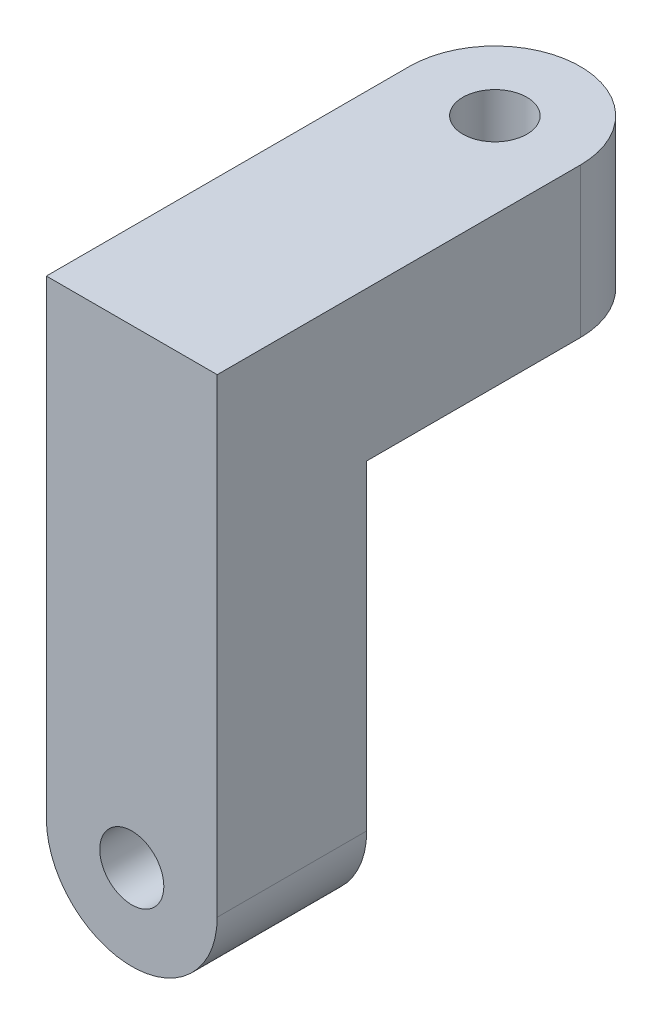
ISO-10303-21;
HEADER;
FILE_DESCRIPTION(('STEP AP214'),'2;1');
FILE_NAME('part.step','',(''),(''),'','','');
FILE_SCHEMA(('AUTOMOTIVE_DESIGN { 1 0 10303 214 1 1 1 1 }'));
ENDSEC;
DATA;
#1=APPLICATION_CONTEXT('core data for automotive mechanical design processes');
#2=APPLICATION_PROTOCOL_DEFINITION('international standard','automotive_design',2000,#1);
#3=PRODUCT_CONTEXT('',#1,'mechanical');
#4=PRODUCT('Part','Part','',(#3));
#5=PRODUCT_RELATED_PRODUCT_CATEGORY('part','',(#4));
#6=PRODUCT_DEFINITION_FORMATION('','',#4);
#7=PRODUCT_DEFINITION_CONTEXT('part definition',#1,'design');
#8=PRODUCT_DEFINITION('design','',#6,#7);
#9=PRODUCT_DEFINITION_SHAPE('','',#8);
#10=(LENGTH_UNIT() NAMED_UNIT(*) SI_UNIT(.MILLI.,.METRE.));
#11=(NAMED_UNIT(*) PLANE_ANGLE_UNIT() SI_UNIT($,.RADIAN.));
#12=(NAMED_UNIT(*) SI_UNIT($,.STERADIAN.) SOLID_ANGLE_UNIT());
#13=UNCERTAINTY_MEASURE_WITH_UNIT(LENGTH_MEASURE(1.E-05),#10,'distance_accuracy_value','');
#14=(GEOMETRIC_REPRESENTATION_CONTEXT(3) GLOBAL_UNCERTAINTY_ASSIGNED_CONTEXT((#13)) GLOBAL_UNIT_ASSIGNED_CONTEXT((#10,
#11,#12)) REPRESENTATION_CONTEXT('',''));
#15=CARTESIAN_POINT('',(0.,0.,0.));
#16=DIRECTION('',(0.,0.,1.));
#17=DIRECTION('',(1.,0.,0.));
#18=AXIS2_PLACEMENT_3D('',#15,#16,#17);
#19=CARTESIAN_POINT('',(0.,-15.,7.));
#20=DIRECTION('',(0.,0.,1.));
#21=DIRECTION('',(1.,0.,0.));
#22=AXIS2_PLACEMENT_3D('',#19,#20,#21);
#23=PLANE('',#22);
#24=CARTESIAN_POINT('',(0.,-15.,7.));
#25=DIRECTION('',(0.,0.,1.));
#26=DIRECTION('',(1.,0.,0.));
#27=AXIS2_PLACEMENT_3D('',#24,#25,#26);
#28=CIRCLE('',#27,4.);
#29=CARTESIAN_POINT('',(-4.,-15.,7.));
#30=VERTEX_POINT('',#29);
#31=CARTESIAN_POINT('',(4.,-15.,7.));
#32=VERTEX_POINT('',#31);
#33=EDGE_CURVE('E78',#30,#32,#28,.T.);
#34=ORIENTED_EDGE('',*,*,#33,.T.);
#35=DIRECTION('',(0.,1.,0.));
#36=VECTOR('',#35,1.);
#37=CARTESIAN_POINT('',(4.,0.,7.));
#38=LINE('',#37,#36);
#39=CARTESIAN_POINT('',(4.,7.,7.));
#40=VERTEX_POINT('',#39);
#41=EDGE_CURVE('E147',#32,#40,#38,.T.);
#42=ORIENTED_EDGE('',*,*,#41,.T.);
#43=DIRECTION('',(1.,0.,0.));
#44=VECTOR('',#43,1.);
#45=CARTESIAN_POINT('',(0.,7.,7.));
#46=LINE('',#45,#44);
#47=CARTESIAN_POINT('',(-4.,7.,7.));
#48=VERTEX_POINT('',#47);
#49=EDGE_CURVE('E136',#48,#40,#46,.T.);
#50=ORIENTED_EDGE('',*,*,#49,.F.);
#51=DIRECTION('',(0.,-1.,0.));
#52=VECTOR('',#51,1.);
#53=CARTESIAN_POINT('',(-4.,-15.,7.));
#54=LINE('',#53,#52);
#55=EDGE_CURVE('E49',#48,#30,#54,.T.);
#56=ORIENTED_EDGE('',*,*,#55,.T.);
#57=EDGE_LOOP('',(#34,#42,#50,#56));
#58=FACE_BOUND('',#57,.T.);
#59=CARTESIAN_POINT('',(0.,-15.,7.));
#60=DIRECTION('',(0.,0.,1.));
#61=DIRECTION('',(1.,0.,0.));
#62=AXIS2_PLACEMENT_3D('',#59,#60,#61);
#63=CIRCLE('',#62,1.5);
#64=CARTESIAN_POINT('',(1.5,-15.,7.));
#65=VERTEX_POINT('',#64);
#66=EDGE_CURVE('E87',#65,#65,#63,.T.);
#67=ORIENTED_EDGE('',*,*,#66,.F.);
#68=EDGE_LOOP('',(#67));
#69=FACE_BOUND('',#68,.T.);
#70=ADVANCED_FACE('F32',(#58,#69),#23,.T.);
#71=CARTESIAN_POINT('',(0.,-15.,0.));
#72=DIRECTION('',(0.,0.,1.));
#73=DIRECTION('',(1.,0.,0.));
#74=AXIS2_PLACEMENT_3D('',#71,#72,#73);
#75=PLANE('',#74);
#76=CARTESIAN_POINT('',(0.,-15.,0.));
#77=DIRECTION('',(0.,0.,1.));
#78=DIRECTION('',(1.,0.,0.));
#79=AXIS2_PLACEMENT_3D('',#76,#77,#78);
#80=CIRCLE('',#79,4.);
#81=CARTESIAN_POINT('',(-4.,-15.,0.));
#82=VERTEX_POINT('',#81);
#83=CARTESIAN_POINT('',(4.,-15.,0.));
#84=VERTEX_POINT('',#83);
#85=EDGE_CURVE('E84',#82,#84,#80,.T.);
#86=ORIENTED_EDGE('',*,*,#85,.F.);
#87=DIRECTION('',(0.,-1.,0.));
#88=VECTOR('',#87,1.);
#89=CARTESIAN_POINT('',(-4.,-15.,0.));
#90=LINE('',#89,#88);
#91=CARTESIAN_POINT('',(-4.,0.,0.));
#92=VERTEX_POINT('',#91);
#93=EDGE_CURVE('E68',#92,#82,#90,.T.);
#94=ORIENTED_EDGE('',*,*,#93,.F.);
#95=DIRECTION('',(-1.,0.,0.));
#96=VECTOR('',#95,1.);
#97=CARTESIAN_POINT('',(-4.,0.,0.));
#98=LINE('',#97,#96);
#99=CARTESIAN_POINT('',(4.,0.,0.));
#100=VERTEX_POINT('',#99);
#101=EDGE_CURVE('E79',#100,#92,#98,.T.);
#102=ORIENTED_EDGE('',*,*,#101,.F.);
#103=DIRECTION('',(0.,1.,0.));
#104=VECTOR('',#103,1.);
#105=CARTESIAN_POINT('',(4.,0.,0.));
#106=LINE('',#105,#104);
#107=EDGE_CURVE('E62',#84,#100,#106,.T.);
#108=ORIENTED_EDGE('',*,*,#107,.F.);
#109=EDGE_LOOP('',(#86,#94,#102,#108));
#110=FACE_BOUND('',#109,.T.);
#111=CARTESIAN_POINT('',(0.,-15.,0.));
#112=DIRECTION('',(0.,0.,1.));
#113=DIRECTION('',(1.,0.,0.));
#114=AXIS2_PLACEMENT_3D('',#111,#112,#113);
#115=CIRCLE('',#114,1.5);
#116=CARTESIAN_POINT('',(1.5,-15.,0.));
#117=VERTEX_POINT('',#116);
#118=EDGE_CURVE('E91',#117,#117,#115,.T.);
#119=ORIENTED_EDGE('',*,*,#118,.T.);
#120=EDGE_LOOP('',(#119));
#121=FACE_BOUND('',#120,.T.);
#122=ADVANCED_FACE('F85',(#110,#121),#75,.F.);
#123=CARTESIAN_POINT('',(0.,-15.,7.));
#124=DIRECTION('',(0.,0.,-1.));
#125=DIRECTION('',(-1.,0.,0.));
#126=AXIS2_PLACEMENT_3D('',#123,#124,#125);
#127=CYLINDRICAL_SURFACE('',#126,4.);
#128=ORIENTED_EDGE('',*,*,#85,.T.);
#129=DIRECTION('',(0.,0.,-1.));
#130=VECTOR('',#129,1.);
#131=CARTESIAN_POINT('',(4.,-15.,7.));
#132=LINE('',#131,#130);
#133=EDGE_CURVE('E11',#32,#84,#132,.T.);
#134=ORIENTED_EDGE('',*,*,#133,.F.);
#135=ORIENTED_EDGE('',*,*,#33,.F.);
#136=DIRECTION('',(0.,0.,-1.));
#137=VECTOR('',#136,1.);
#138=CARTESIAN_POINT('',(-4.,-15.,7.));
#139=LINE('',#138,#137);
#140=EDGE_CURVE('E41',#30,#82,#139,.T.);
#141=ORIENTED_EDGE('',*,*,#140,.T.);
#142=EDGE_LOOP('',(#128,#134,#135,#141));
#143=FACE_BOUND('',#142,.T.);
#144=ADVANCED_FACE('F34',(#143),#127,.T.);
#145=CARTESIAN_POINT('',(4.,0.,7.));
#146=DIRECTION('',(-1.,0.,0.));
#147=DIRECTION('',(0.,0.,1.));
#148=AXIS2_PLACEMENT_3D('',#145,#146,#147);
#149=PLANE('',#148);
#150=ORIENTED_EDGE('',*,*,#107,.T.);
#151=DIRECTION('',(0.,0.,-1.));
#152=VECTOR('',#151,1.);
#153=CARTESIAN_POINT('',(4.,0.,0.));
#154=LINE('',#153,#152);
#155=CARTESIAN_POINT('',(4.,0.,-10.));
#156=VERTEX_POINT('',#155);
#157=EDGE_CURVE('E101',#100,#156,#154,.T.);
#158=ORIENTED_EDGE('',*,*,#157,.T.);
#159=DIRECTION('',(0.,-1.,0.));
#160=VECTOR('',#159,1.);
#161=CARTESIAN_POINT('',(4.,7.,-10.));
#162=LINE('',#161,#160);
#163=CARTESIAN_POINT('',(4.,7.,-10.));
#164=VERTEX_POINT('',#163);
#165=EDGE_CURVE('E124',#164,#156,#162,.T.);
#166=ORIENTED_EDGE('',*,*,#165,.F.);
#167=DIRECTION('',(0.,0.,-1.));
#168=VECTOR('',#167,1.);
#169=CARTESIAN_POINT('',(4.,7.,0.));
#170=LINE('',#169,#168);
#171=EDGE_CURVE('E130',#40,#164,#170,.T.);
#172=ORIENTED_EDGE('',*,*,#171,.F.);
#173=ORIENTED_EDGE('',*,*,#41,.F.);
#174=ORIENTED_EDGE('',*,*,#133,.T.);
#175=EDGE_LOOP('',(#150,#158,#166,#172,#173,#174));
#176=FACE_BOUND('',#175,.T.);
#177=ADVANCED_FACE('F139',(#176),#149,.F.);
#178=CARTESIAN_POINT('',(-4.,-15.,7.));
#179=DIRECTION('',(1.,0.,0.));
#180=DIRECTION('',(0.,0.,-1.));
#181=AXIS2_PLACEMENT_3D('',#178,#179,#180);
#182=PLANE('',#181);
#183=ORIENTED_EDGE('',*,*,#93,.T.);
#184=ORIENTED_EDGE('',*,*,#140,.F.);
#185=ORIENTED_EDGE('',*,*,#55,.F.);
#186=DIRECTION('',(0.,0.,1.));
#187=VECTOR('',#186,1.);
#188=CARTESIAN_POINT('',(-4.,7.,0.));
#189=LINE('',#188,#187);
#190=CARTESIAN_POINT('',(-4.,7.,-10.));
#191=VERTEX_POINT('',#190);
#192=EDGE_CURVE('E129',#191,#48,#189,.T.);
#193=ORIENTED_EDGE('',*,*,#192,.F.);
#194=DIRECTION('',(0.,-1.,0.));
#195=VECTOR('',#194,1.);
#196=CARTESIAN_POINT('',(-4.,7.,-10.));
#197=LINE('',#196,#195);
#198=CARTESIAN_POINT('',(-4.,0.,-10.));
#199=VERTEX_POINT('',#198);
#200=EDGE_CURVE('E125',#191,#199,#197,.T.);
#201=ORIENTED_EDGE('',*,*,#200,.T.);
#202=DIRECTION('',(0.,0.,1.));
#203=VECTOR('',#202,1.);
#204=CARTESIAN_POINT('',(-4.,0.,0.));
#205=LINE('',#204,#203);
#206=EDGE_CURVE('E74',#199,#92,#205,.T.);
#207=ORIENTED_EDGE('',*,*,#206,.T.);
#208=EDGE_LOOP('',(#183,#184,#185,#193,#201,#207));
#209=FACE_BOUND('',#208,.T.);
#210=ADVANCED_FACE('F70',(#209),#182,.F.);
#211=CARTESIAN_POINT('',(0.,-15.,7.));
#212=DIRECTION('',(0.,0.,-1.));
#213=DIRECTION('',(-1.,0.,0.));
#214=AXIS2_PLACEMENT_3D('',#211,#212,#213);
#215=CYLINDRICAL_SURFACE('',#214,1.5);
#216=ORIENTED_EDGE('',*,*,#66,.T.);
#217=EDGE_LOOP('',(#216));
#218=FACE_BOUND('',#217,.T.);
#219=ORIENTED_EDGE('',*,*,#118,.F.);
#220=EDGE_LOOP('',(#219));
#221=FACE_BOUND('',#220,.T.);
#222=ADVANCED_FACE('F179',(#218,#221),#215,.F.);
#223=CARTESIAN_POINT('',(0.,0.,0.));
#224=DIRECTION('',(0.,1.,0.));
#225=DIRECTION('',(0.,0.,1.));
#226=AXIS2_PLACEMENT_3D('',#223,#224,#225);
#227=PLANE('',#226);
#228=CARTESIAN_POINT('',(0.,0.,-10.));
#229=DIRECTION('',(0.,1.,0.));
#230=DIRECTION('',(0.,0.,1.));
#231=AXIS2_PLACEMENT_3D('',#228,#229,#230);
#232=CIRCLE('',#231,1.5);
#233=CARTESIAN_POINT('',(0.,0.,-8.5));
#234=VERTEX_POINT('',#233);
#235=EDGE_CURVE('E137',#234,#234,#232,.T.);
#236=ORIENTED_EDGE('',*,*,#235,.T.);
#237=EDGE_LOOP('',(#236));
#238=FACE_BOUND('',#237,.T.);
#239=ORIENTED_EDGE('',*,*,#157,.F.);
#240=ORIENTED_EDGE('',*,*,#101,.T.);
#241=ORIENTED_EDGE('',*,*,#206,.F.);
#242=CARTESIAN_POINT('',(0.,0.,-10.));
#243=DIRECTION('',(0.,1.,0.));
#244=DIRECTION('',(0.,0.,1.));
#245=AXIS2_PLACEMENT_3D('',#242,#243,#244);
#246=CIRCLE('',#245,4.);
#247=EDGE_CURVE('E155',#156,#199,#246,.T.);
#248=ORIENTED_EDGE('',*,*,#247,.F.);
#249=EDGE_LOOP('',(#239,#240,#241,#248));
#250=FACE_BOUND('',#249,.T.);
#251=ADVANCED_FACE('F98',(#238,#250),#227,.F.);
#252=CARTESIAN_POINT('',(0.,7.,-10.));
#253=DIRECTION('',(0.,-1.,0.));
#254=DIRECTION('',(0.,0.,-1.));
#255=AXIS2_PLACEMENT_3D('',#252,#253,#254);
#256=CYLINDRICAL_SURFACE('',#255,4.);
#257=ORIENTED_EDGE('',*,*,#247,.T.);
#258=ORIENTED_EDGE('',*,*,#200,.F.);
#259=CARTESIAN_POINT('',(0.,7.,-10.));
#260=DIRECTION('',(0.,1.,0.));
#261=DIRECTION('',(0.,0.,1.));
#262=AXIS2_PLACEMENT_3D('',#259,#260,#261);
#263=CIRCLE('',#262,4.);
#264=EDGE_CURVE('E120',#164,#191,#263,.T.);
#265=ORIENTED_EDGE('',*,*,#264,.F.);
#266=ORIENTED_EDGE('',*,*,#165,.T.);
#267=EDGE_LOOP('',(#257,#258,#265,#266));
#268=FACE_BOUND('',#267,.T.);
#269=ADVANCED_FACE('F122',(#268),#256,.T.);
#270=CARTESIAN_POINT('',(0.,7.,-10.));
#271=DIRECTION('',(0.,-1.,0.));
#272=DIRECTION('',(0.,0.,-1.));
#273=AXIS2_PLACEMENT_3D('',#270,#271,#272);
#274=CYLINDRICAL_SURFACE('',#273,1.5);
#275=CARTESIAN_POINT('',(0.,7.,-10.));
#276=DIRECTION('',(0.,1.,0.));
#277=DIRECTION('',(0.,0.,1.));
#278=AXIS2_PLACEMENT_3D('',#275,#276,#277);
#279=CIRCLE('',#278,1.5);
#280=CARTESIAN_POINT('',(0.,7.,-8.5));
#281=VERTEX_POINT('',#280);
#282=EDGE_CURVE('E143',#281,#281,#279,.T.);
#283=ORIENTED_EDGE('',*,*,#282,.T.);
#284=EDGE_LOOP('',(#283));
#285=FACE_BOUND('',#284,.T.);
#286=ORIENTED_EDGE('',*,*,#235,.F.);
#287=EDGE_LOOP('',(#286));
#288=FACE_BOUND('',#287,.T.);
#289=ADVANCED_FACE('F161',(#285,#288),#274,.F.);
#290=CARTESIAN_POINT('',(0.,7.,0.));
#291=DIRECTION('',(0.,1.,0.));
#292=DIRECTION('',(0.,0.,1.));
#293=AXIS2_PLACEMENT_3D('',#290,#291,#292);
#294=PLANE('',#293);
#295=ORIENTED_EDGE('',*,*,#171,.T.);
#296=ORIENTED_EDGE('',*,*,#264,.T.);
#297=ORIENTED_EDGE('',*,*,#192,.T.);
#298=ORIENTED_EDGE('',*,*,#49,.T.);
#299=EDGE_LOOP('',(#295,#296,#297,#298));
#300=FACE_BOUND('',#299,.T.);
#301=ORIENTED_EDGE('',*,*,#282,.F.);
#302=EDGE_LOOP('',(#301));
#303=FACE_BOUND('',#302,.T.);
#304=ADVANCED_FACE('F134',(#300,#303),#294,.T.);
#305=CLOSED_SHELL('',(#70,#122,#144,#177,#210,#222,#251,#269,#289,#304));
#306=MANIFOLD_SOLID_BREP('B2',#305);
#307=ADVANCED_BREP_SHAPE_REPRESENTATION('',(#18,#306),#14);
#308=SHAPE_DEFINITION_REPRESENTATION(#9,#307);
ENDSEC;
END-ISO-10303-21;
